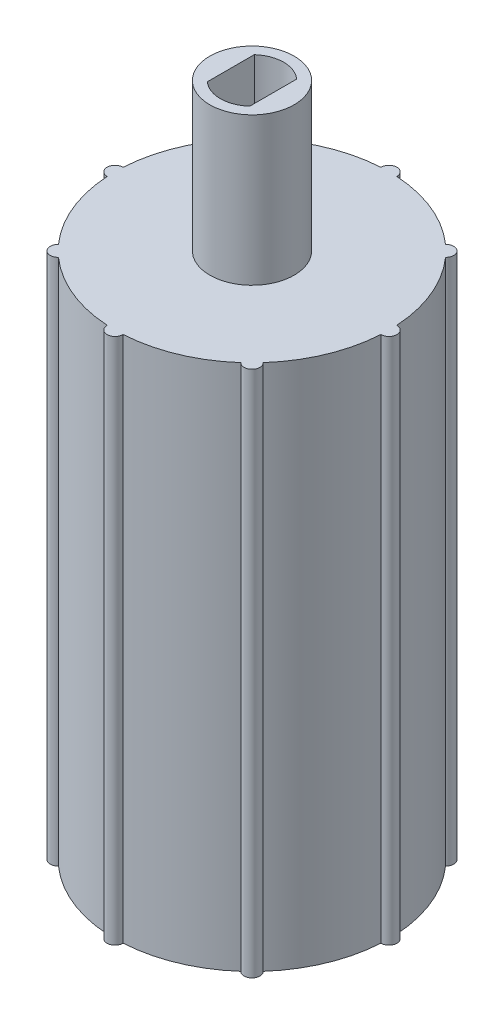
ISO-10303-21;
HEADER;
FILE_DESCRIPTION(('STEP AP214'),'2;1');
FILE_NAME('part.step','',(''),(''),'','','');
FILE_SCHEMA(('AUTOMOTIVE_DESIGN { 1 0 10303 214 1 1 1 1 }'));
ENDSEC;
DATA;
#1=APPLICATION_CONTEXT('core data for automotive mechanical design processes');
#2=APPLICATION_PROTOCOL_DEFINITION('international standard','automotive_design',2000,#1);
#3=PRODUCT_CONTEXT('',#1,'mechanical');
#4=PRODUCT('Part','Part','',(#3));
#5=PRODUCT_RELATED_PRODUCT_CATEGORY('part','',(#4));
#6=PRODUCT_DEFINITION_FORMATION('','',#4);
#7=PRODUCT_DEFINITION_CONTEXT('part definition',#1,'design');
#8=PRODUCT_DEFINITION('design','',#6,#7);
#9=PRODUCT_DEFINITION_SHAPE('','',#8);
#10=(LENGTH_UNIT() NAMED_UNIT(*) SI_UNIT(.MILLI.,.METRE.));
#11=(NAMED_UNIT(*) PLANE_ANGLE_UNIT() SI_UNIT($,.RADIAN.));
#12=(NAMED_UNIT(*) SI_UNIT($,.STERADIAN.) SOLID_ANGLE_UNIT());
#13=UNCERTAINTY_MEASURE_WITH_UNIT(LENGTH_MEASURE(1.E-05),#10,'distance_accuracy_value','');
#14=(GEOMETRIC_REPRESENTATION_CONTEXT(3) GLOBAL_UNCERTAINTY_ASSIGNED_CONTEXT((#13)) GLOBAL_UNIT_ASSIGNED_CONTEXT((#10,
#11,#12)) REPRESENTATION_CONTEXT('',''));
#15=CARTESIAN_POINT('',(0.,0.,0.));
#16=DIRECTION('',(0.,0.,1.));
#17=DIRECTION('',(1.,0.,0.));
#18=AXIS2_PLACEMENT_3D('',#15,#16,#17);
#19=CARTESIAN_POINT('',(0.,50.,0.));
#20=DIRECTION('',(0.,-1.,0.));
#21=DIRECTION('',(0.,0.,-1.));
#22=AXIS2_PLACEMENT_3D('',#19,#20,#21);
#23=CYLINDRICAL_SURFACE('',#22,9.);
#24=CARTESIAN_POINT('',(0.,7.,0.));
#25=DIRECTION('',(0.,-1.,0.));
#26=DIRECTION('',(0.,0.,-1.));
#27=AXIS2_PLACEMENT_3D('',#24,#25,#26);
#28=CIRCLE('',#27,9.);
#29=CARTESIAN_POINT('',(0.,7.,-9.));
#30=VERTEX_POINT('',#29);
#31=EDGE_CURVE('E310',#30,#30,#28,.F.);
#32=ORIENTED_EDGE('',*,*,#31,.F.);
#33=EDGE_LOOP('',(#32));
#34=FACE_BOUND('',#33,.T.);
#35=CARTESIAN_POINT('',(0.,47.,0.));
#36=DIRECTION('',(0.,1.,0.));
#37=DIRECTION('',(0.,0.,1.));
#38=AXIS2_PLACEMENT_3D('',#35,#36,#37);
#39=CIRCLE('',#38,9.);
#40=CARTESIAN_POINT('',(0.,47.,9.));
#41=VERTEX_POINT('',#40);
#42=EDGE_CURVE('E43',#41,#41,#39,.F.);
#43=ORIENTED_EDGE('',*,*,#42,.F.);
#44=EDGE_LOOP('',(#43));
#45=FACE_BOUND('',#44,.T.);
#46=ADVANCED_FACE('F39',(#34,#45),#23,.F.);
#47=CARTESIAN_POINT('',(0.,50.,0.));
#48=DIRECTION('',(0.,-1.,0.));
#49=DIRECTION('',(0.,0.,-1.));
#50=AXIS2_PLACEMENT_3D('',#47,#48,#49);
#51=CYLINDRICAL_SURFACE('',#50,13.);
#52=CARTESIAN_POINT('',(0.,0.,0.));
#53=DIRECTION('',(0.,1.,0.));
#54=DIRECTION('',(0.,0.,1.));
#55=AXIS2_PLACEMENT_3D('',#52,#53,#54);
#56=CIRCLE('',#55,13.);
#57=CARTESIAN_POINT('',(0.749687897339529,0.,12.9783653846154));
#58=VERTEX_POINT('',#57);
#59=CARTESIAN_POINT('',(8.64698077619625,0.,9.70719956816034));
#60=VERTEX_POINT('',#59);
#61=EDGE_CURVE('E323',#58,#60,#56,.T.);
#62=ORIENTED_EDGE('',*,*,#61,.T.);
#63=DIRECTION('',(0.,-1.,0.));
#64=VECTOR('',#63,1.);
#65=CARTESIAN_POINT('',(8.64698077619624,25.,9.70719956816036));
#66=LINE('',#65,#64);
#67=CARTESIAN_POINT('',(8.64698077619625,50.,9.70719956816034));
#68=VERTEX_POINT('',#67);
#69=EDGE_CURVE('E227',#60,#68,#66,.F.);
#70=ORIENTED_EDGE('',*,*,#69,.T.);
#71=CARTESIAN_POINT('',(0.,50.,0.));
#72=DIRECTION('',(0.,1.,0.));
#73=DIRECTION('',(0.,0.,1.));
#74=AXIS2_PLACEMENT_3D('',#71,#72,#73);
#75=CIRCLE('',#74,13.);
#76=CARTESIAN_POINT('',(0.749687897339512,50.,12.9783653846154));
#77=VERTEX_POINT('',#76);
#78=EDGE_CURVE('E369',#77,#68,#75,.T.);
#79=ORIENTED_EDGE('',*,*,#78,.F.);
#80=DIRECTION('',(0.,-1.,0.));
#81=VECTOR('',#80,1.);
#82=CARTESIAN_POINT('',(0.749687897339529,25.,12.9783653846154));
#83=LINE('',#82,#81);
#84=EDGE_CURVE('E233',#77,#58,#83,.T.);
#85=ORIENTED_EDGE('',*,*,#84,.T.);
#86=EDGE_LOOP('',(#62,#70,#79,#85));
#87=FACE_BOUND('',#86,.T.);
#88=ADVANCED_FACE('F385',(#87),#51,.T.);
#89=CARTESIAN_POINT('',(-8.64698077619604,0.,9.70719956816054));
#90=VERTEX_POINT('',#89);
#91=CARTESIAN_POINT('',(-0.74968789733924,0.,12.9783653846154));
#92=VERTEX_POINT('',#91);
#93=EDGE_CURVE('E325',#90,#92,#56,.T.);
#94=ORIENTED_EDGE('',*,*,#93,.T.);
#95=DIRECTION('',(0.,-1.,0.));
#96=VECTOR('',#95,1.);
#97=CARTESIAN_POINT('',(-0.749687897339257,25.,12.9783653846154));
#98=LINE('',#97,#96);
#99=CARTESIAN_POINT('',(-0.74968789733924,50.,12.9783653846154));
#100=VERTEX_POINT('',#99);
#101=EDGE_CURVE('E238',#92,#100,#98,.F.);
#102=ORIENTED_EDGE('',*,*,#101,.T.);
#103=CARTESIAN_POINT('',(-8.64698077619605,50.,9.70719956816052));
#104=VERTEX_POINT('',#103);
#105=EDGE_CURVE('E366',#104,#100,#75,.T.);
#106=ORIENTED_EDGE('',*,*,#105,.F.);
#107=DIRECTION('',(0.,-1.,0.));
#108=VECTOR('',#107,1.);
#109=CARTESIAN_POINT('',(-8.64698077619604,25.,9.70719956816054));
#110=LINE('',#109,#108);
#111=EDGE_CURVE('E244',#104,#90,#110,.T.);
#112=ORIENTED_EDGE('',*,*,#111,.T.);
#113=EDGE_LOOP('',(#94,#102,#106,#112));
#114=FACE_BOUND('',#113,.T.);
#115=ADVANCED_FACE('F392',(#114),#51,.T.);
#116=CARTESIAN_POINT('',(-12.9783653846154,0.,0.749687897339393));
#117=VERTEX_POINT('',#116);
#118=CARTESIAN_POINT('',(-9.70719956816037,0.,8.64698077619622));
#119=VERTEX_POINT('',#118);
#120=EDGE_CURVE('E328',#117,#119,#56,.T.);
#121=ORIENTED_EDGE('',*,*,#120,.T.);
#122=DIRECTION('',(0.,-1.,0.));
#123=VECTOR('',#122,1.);
#124=CARTESIAN_POINT('',(-9.70719956816039,25.,8.64698077619621));
#125=LINE('',#124,#123);
#126=CARTESIAN_POINT('',(-9.70719956816037,50.,8.64698077619622));
#127=VERTEX_POINT('',#126);
#128=EDGE_CURVE('E249',#119,#127,#125,.F.);
#129=ORIENTED_EDGE('',*,*,#128,.T.);
#130=CARTESIAN_POINT('',(-12.9783653846154,50.,0.749687897339376));
#131=VERTEX_POINT('',#130);
#132=EDGE_CURVE('E363',#131,#127,#75,.T.);
#133=ORIENTED_EDGE('',*,*,#132,.F.);
#134=DIRECTION('',(0.,-1.,0.));
#135=VECTOR('',#134,1.);
#136=CARTESIAN_POINT('',(-12.9783653846154,25.,0.749687897339393));
#137=LINE('',#136,#135);
#138=EDGE_CURVE('E255',#131,#117,#137,.T.);
#139=ORIENTED_EDGE('',*,*,#138,.T.);
#140=EDGE_LOOP('',(#121,#129,#133,#139));
#141=FACE_BOUND('',#140,.T.);
#142=ADVANCED_FACE('F395',(#141),#51,.T.);
#143=CARTESIAN_POINT('',(-9.70719956816051,0.,-8.64698077619607));
#144=VERTEX_POINT('',#143);
#145=CARTESIAN_POINT('',(-12.9783653846154,0.,-0.749687897339376));
#146=VERTEX_POINT('',#145);
#147=EDGE_CURVE('E331',#144,#146,#56,.T.);
#148=ORIENTED_EDGE('',*,*,#147,.T.);
#149=DIRECTION('',(0.,-1.,0.));
#150=VECTOR('',#149,1.);
#151=CARTESIAN_POINT('',(-12.9783653846154,25.,-0.749687897339393));
#152=LINE('',#151,#150);
#153=CARTESIAN_POINT('',(-12.9783653846154,50.,-0.749687897339376));
#154=VERTEX_POINT('',#153);
#155=EDGE_CURVE('E260',#146,#154,#152,.F.);
#156=ORIENTED_EDGE('',*,*,#155,.T.);
#157=CARTESIAN_POINT('',(-9.70719956816049,50.,-8.64698077619608));
#158=VERTEX_POINT('',#157);
#159=EDGE_CURVE('E361',#158,#154,#75,.T.);
#160=ORIENTED_EDGE('',*,*,#159,.F.);
#161=DIRECTION('',(0.,-1.,0.));
#162=VECTOR('',#161,1.);
#163=CARTESIAN_POINT('',(-9.70719956816051,25.,-8.64698077619607));
#164=LINE('',#163,#162);
#165=EDGE_CURVE('E266',#158,#144,#164,.T.);
#166=ORIENTED_EDGE('',*,*,#165,.T.);
#167=EDGE_LOOP('',(#148,#156,#160,#166));
#168=FACE_BOUND('',#167,.T.);
#169=ADVANCED_FACE('F401',(#168),#51,.T.);
#170=CARTESIAN_POINT('',(-0.749687897339438,0.,-12.9783653846154));
#171=VERTEX_POINT('',#170);
#172=CARTESIAN_POINT('',(-8.64698077619619,0.,-9.7071995681604));
#173=VERTEX_POINT('',#172);
#174=EDGE_CURVE('E334',#171,#173,#56,.T.);
#175=ORIENTED_EDGE('',*,*,#174,.T.);
#176=DIRECTION('',(0.,-1.,0.));
#177=VECTOR('',#176,1.);
#178=CARTESIAN_POINT('',(-8.64698077619617,25.,-9.70719956816041));
#179=LINE('',#178,#177);
#180=CARTESIAN_POINT('',(-8.64698077619619,50.,-9.7071995681604));
#181=VERTEX_POINT('',#180);
#182=EDGE_CURVE('E271',#173,#181,#179,.F.);
#183=ORIENTED_EDGE('',*,*,#182,.T.);
#184=CARTESIAN_POINT('',(-0.749687897339422,50.,-12.9783653846154));
#185=VERTEX_POINT('',#184);
#186=EDGE_CURVE('E355',#185,#181,#75,.T.);
#187=ORIENTED_EDGE('',*,*,#186,.F.);
#188=DIRECTION('',(0.,-1.,0.));
#189=VECTOR('',#188,1.);
#190=CARTESIAN_POINT('',(-0.749687897339438,25.,-12.9783653846154));
#191=LINE('',#190,#189);
#192=EDGE_CURVE('E277',#185,#171,#191,.T.);
#193=ORIENTED_EDGE('',*,*,#192,.T.);
#194=EDGE_LOOP('',(#175,#183,#187,#193));
#195=FACE_BOUND('',#194,.T.);
#196=ADVANCED_FACE('F353',(#195),#51,.T.);
#197=CARTESIAN_POINT('',(8.64698077619611,0.,-9.70719956816048));
#198=VERTEX_POINT('',#197);
#199=CARTESIAN_POINT('',(0.749687897339331,0.,-12.9783653846154));
#200=VERTEX_POINT('',#199);
#201=EDGE_CURVE('E318',#198,#200,#56,.T.);
#202=ORIENTED_EDGE('',*,*,#201,.T.);
#203=DIRECTION('',(0.,-1.,0.));
#204=VECTOR('',#203,1.);
#205=CARTESIAN_POINT('',(0.749687897339348,25.,-12.9783653846154));
#206=LINE('',#205,#204);
#207=CARTESIAN_POINT('',(0.749687897339331,50.,-12.9783653846154));
#208=VERTEX_POINT('',#207);
#209=EDGE_CURVE('E282',#200,#208,#206,.F.);
#210=ORIENTED_EDGE('',*,*,#209,.T.);
#211=CARTESIAN_POINT('',(8.64698077619612,50.,-9.70719956816046));
#212=VERTEX_POINT('',#211);
#213=EDGE_CURVE('E316',#212,#208,#75,.T.);
#214=ORIENTED_EDGE('',*,*,#213,.F.);
#215=DIRECTION('',(0.,-1.,0.));
#216=VECTOR('',#215,1.);
#217=CARTESIAN_POINT('',(8.64698077619611,25.,-9.70719956816048));
#218=LINE('',#217,#216);
#219=EDGE_CURVE('E288',#212,#198,#218,.T.);
#220=ORIENTED_EDGE('',*,*,#219,.T.);
#221=EDGE_LOOP('',(#202,#210,#214,#220));
#222=FACE_BOUND('',#221,.T.);
#223=ADVANCED_FACE('F341',(#222),#51,.T.);
#224=CARTESIAN_POINT('',(12.9783653846154,0.,-0.749687897339393));
#225=VERTEX_POINT('',#224);
#226=CARTESIAN_POINT('',(9.70719956816043,0.,-8.64698077619615));
#227=VERTEX_POINT('',#226);
#228=EDGE_CURVE('E317',#225,#227,#56,.T.);
#229=ORIENTED_EDGE('',*,*,#228,.T.);
#230=DIRECTION('',(0.,-1.,0.));
#231=VECTOR('',#230,1.);
#232=CARTESIAN_POINT('',(9.70719956816045,25.,-8.64698077619614));
#233=LINE('',#232,#231);
#234=CARTESIAN_POINT('',(9.70719956816043,50.,-8.64698077619615));
#235=VERTEX_POINT('',#234);
#236=EDGE_CURVE('E293',#227,#235,#233,.F.);
#237=ORIENTED_EDGE('',*,*,#236,.T.);
#238=CARTESIAN_POINT('',(12.9783653846154,50.,-0.749687897339376));
#239=VERTEX_POINT('',#238);
#240=EDGE_CURVE('E313',#239,#235,#75,.T.);
#241=ORIENTED_EDGE('',*,*,#240,.F.);
#242=DIRECTION('',(0.,-1.,0.));
#243=VECTOR('',#242,1.);
#244=CARTESIAN_POINT('',(12.9783653846154,25.,-0.749687897339393));
#245=LINE('',#244,#243);
#246=EDGE_CURVE('E299',#239,#225,#245,.T.);
#247=ORIENTED_EDGE('',*,*,#246,.T.);
#248=EDGE_LOOP('',(#229,#237,#241,#247));
#249=FACE_BOUND('',#248,.T.);
#250=ADVANCED_FACE('F378',(#249),#51,.T.);
#251=CARTESIAN_POINT('',(9.70719956816056,50.,8.64698077619602));
#252=VERTEX_POINT('',#251);
#253=CARTESIAN_POINT('',(12.9783653846154,50.,0.749687897339376));
#254=VERTEX_POINT('',#253);
#255=EDGE_CURVE('E63',#252,#254,#75,.T.);
#256=ORIENTED_EDGE('',*,*,#255,.F.);
#257=DIRECTION('',(0.,-1.,0.));
#258=VECTOR('',#257,1.);
#259=CARTESIAN_POINT('',(9.70719956816057,25.,8.646980776196));
#260=LINE('',#259,#258);
#261=CARTESIAN_POINT('',(9.70719956816057,0.,8.646980776196));
#262=VERTEX_POINT('',#261);
#263=EDGE_CURVE('E223',#252,#262,#260,.T.);
#264=ORIENTED_EDGE('',*,*,#263,.T.);
#265=CARTESIAN_POINT('',(12.9783653846154,0.,0.749687897339376));
#266=VERTEX_POINT('',#265);
#267=EDGE_CURVE('E319',#262,#266,#56,.T.);
#268=ORIENTED_EDGE('',*,*,#267,.T.);
#269=DIRECTION('',(0.,-1.,0.));
#270=VECTOR('',#269,1.);
#271=CARTESIAN_POINT('',(12.9783653846154,25.,0.749687897339393));
#272=LINE('',#271,#270);
#273=EDGE_CURVE('E304',#266,#254,#272,.F.);
#274=ORIENTED_EDGE('',*,*,#273,.T.);
#275=EDGE_LOOP('',(#256,#264,#268,#274));
#276=FACE_BOUND('',#275,.T.);
#277=ADVANCED_FACE('F41',(#276),#51,.T.);
#278=CARTESIAN_POINT('',(0.,50.,0.));
#279=DIRECTION('',(0.,1.,0.));
#280=DIRECTION('',(0.,0.,1.));
#281=AXIS2_PLACEMENT_3D('',#278,#279,#280);
#282=PLANE('',#281);
#283=CARTESIAN_POINT('',(0.,50.,0.));
#284=DIRECTION('',(0.,1.,0.));
#285=DIRECTION('',(0.,0.,1.));
#286=AXIS2_PLACEMENT_3D('',#283,#284,#285);
#287=CIRCLE('',#286,4.);
#288=CARTESIAN_POINT('',(0.,50.,4.));
#289=VERTEX_POINT('',#288);
#290=EDGE_CURVE('E11',#289,#289,#287,.T.);
#291=ORIENTED_EDGE('',*,*,#290,.F.);
#292=EDGE_LOOP('',(#291));
#293=FACE_BOUND('',#292,.T.);
#294=ORIENTED_EDGE('',*,*,#78,.T.);
#295=CARTESIAN_POINT('',(9.19238815542523,50.,9.192388155425));
#296=DIRECTION('',(0.,-1.,0.));
#297=DIRECTION('',(0.707106781186539,0.,-0.707106781186556));
#298=AXIS2_PLACEMENT_3D('',#295,#296,#297);
#299=CIRCLE('',#298,0.75);
#300=EDGE_CURVE('E220',#252,#68,#299,.T.);
#301=ORIENTED_EDGE('',*,*,#300,.F.);
#302=ORIENTED_EDGE('',*,*,#255,.T.);
#303=CARTESIAN_POINT('',(13.,50.,0.));
#304=DIRECTION('',(0.,-1.,0.));
#305=DIRECTION('',(0.,0.,-1.));
#306=AXIS2_PLACEMENT_3D('',#303,#304,#305);
#307=CIRCLE('',#306,0.75);
#308=EDGE_CURVE('E296',#239,#254,#307,.T.);
#309=ORIENTED_EDGE('',*,*,#308,.F.);
#310=ORIENTED_EDGE('',*,*,#240,.T.);
#311=CARTESIAN_POINT('',(9.1923881554251,50.,-9.19238815542513));
#312=DIRECTION('',(0.,-1.,0.));
#313=DIRECTION('',(-0.707106781186549,0.,-0.707106781186546));
#314=AXIS2_PLACEMENT_3D('',#311,#312,#313);
#315=CIRCLE('',#314,0.75);
#316=EDGE_CURVE('E285',#212,#235,#315,.T.);
#317=ORIENTED_EDGE('',*,*,#316,.F.);
#318=ORIENTED_EDGE('',*,*,#213,.T.);
#319=CARTESIAN_POINT('',(0.,50.,-13.));
#320=DIRECTION('',(0.,-1.,0.));
#321=DIRECTION('',(-1.,0.,0.));
#322=AXIS2_PLACEMENT_3D('',#319,#320,#321);
#323=CIRCLE('',#322,0.75);
#324=EDGE_CURVE('E274',#185,#208,#323,.T.);
#325=ORIENTED_EDGE('',*,*,#324,.F.);
#326=ORIENTED_EDGE('',*,*,#186,.T.);
#327=CARTESIAN_POINT('',(-9.19238815542517,50.,-9.19238815542507));
#328=DIRECTION('',(0.,-1.,0.));
#329=DIRECTION('',(-0.707106781186544,0.,0.707106781186551));
#330=AXIS2_PLACEMENT_3D('',#327,#328,#329);
#331=CIRCLE('',#330,0.75);
#332=EDGE_CURVE('E263',#158,#181,#331,.T.);
#333=ORIENTED_EDGE('',*,*,#332,.F.);
#334=ORIENTED_EDGE('',*,*,#159,.T.);
#335=CARTESIAN_POINT('',(-13.,50.,0.));
#336=DIRECTION('',(0.,-1.,0.));
#337=DIRECTION('',(0.,0.,1.));
#338=AXIS2_PLACEMENT_3D('',#335,#336,#337);
#339=CIRCLE('',#338,0.75);
#340=EDGE_CURVE('E252',#131,#154,#339,.T.);
#341=ORIENTED_EDGE('',*,*,#340,.F.);
#342=ORIENTED_EDGE('',*,*,#132,.T.);
#343=CARTESIAN_POINT('',(-9.19238815542504,50.,9.1923881554252));
#344=DIRECTION('',(0.,-1.,0.));
#345=DIRECTION('',(0.707106781186554,0.,0.707106781186541));
#346=AXIS2_PLACEMENT_3D('',#343,#344,#345);
#347=CIRCLE('',#346,0.75);
#348=EDGE_CURVE('E241',#104,#127,#347,.T.);
#349=ORIENTED_EDGE('',*,*,#348,.F.);
#350=ORIENTED_EDGE('',*,*,#105,.T.);
#351=CARTESIAN_POINT('',(1.36167772214882E-13,50.,13.));
#352=DIRECTION('',(0.,-1.,0.));
#353=DIRECTION('',(1.,0.,0.));
#354=AXIS2_PLACEMENT_3D('',#351,#352,#353);
#355=CIRCLE('',#354,0.75);
#356=EDGE_CURVE('E230',#77,#100,#355,.T.);
#357=ORIENTED_EDGE('',*,*,#356,.F.);
#358=EDGE_LOOP('',(#294,#301,#302,#309,#310,#317,#318,#325,#326,#333,#334,#341,#342,#349,#350,#357));
#359=FACE_BOUND('',#358,.T.);
#360=ADVANCED_FACE('F358',(#293,#359),#282,.T.);
#361=CARTESIAN_POINT('',(0.,0.,0.));
#362=DIRECTION('',(0.,1.,0.));
#363=DIRECTION('',(0.,0.,1.));
#364=AXIS2_PLACEMENT_3D('',#361,#362,#363);
#365=PLANE('',#364);
#366=CARTESIAN_POINT('',(0.,0.,0.));
#367=DIRECTION('',(0.,-1.,0.));
#368=DIRECTION('',(0.,0.,-1.));
#369=AXIS2_PLACEMENT_3D('',#366,#367,#368);
#370=CIRCLE('',#369,11.);
#371=CARTESIAN_POINT('',(0.,0.,-11.));
#372=VERTEX_POINT('',#371);
#373=EDGE_CURVE('E306',#372,#372,#370,.T.);
#374=ORIENTED_EDGE('',*,*,#373,.F.);
#375=EDGE_LOOP('',(#374));
#376=FACE_BOUND('',#375,.T.);
#377=ORIENTED_EDGE('',*,*,#267,.F.);
#378=CARTESIAN_POINT('',(9.19238815542523,0.,9.192388155425));
#379=DIRECTION('',(0.,-1.,0.));
#380=DIRECTION('',(0.707106781186539,0.,-0.707106781186556));
#381=AXIS2_PLACEMENT_3D('',#378,#379,#380);
#382=CIRCLE('',#381,0.75);
#383=EDGE_CURVE('E218',#262,#60,#382,.T.);
#384=ORIENTED_EDGE('',*,*,#383,.T.);
#385=ORIENTED_EDGE('',*,*,#61,.F.);
#386=CARTESIAN_POINT('',(1.36167772214882E-13,0.,13.));
#387=DIRECTION('',(0.,-1.,0.));
#388=DIRECTION('',(1.,0.,0.));
#389=AXIS2_PLACEMENT_3D('',#386,#387,#388);
#390=CIRCLE('',#389,0.75);
#391=EDGE_CURVE('E229',#58,#92,#390,.T.);
#392=ORIENTED_EDGE('',*,*,#391,.T.);
#393=ORIENTED_EDGE('',*,*,#93,.F.);
#394=CARTESIAN_POINT('',(-9.19238815542504,0.,9.1923881554252));
#395=DIRECTION('',(0.,-1.,0.));
#396=DIRECTION('',(0.707106781186554,0.,0.707106781186541));
#397=AXIS2_PLACEMENT_3D('',#394,#395,#396);
#398=CIRCLE('',#397,0.75);
#399=EDGE_CURVE('E240',#90,#119,#398,.T.);
#400=ORIENTED_EDGE('',*,*,#399,.T.);
#401=ORIENTED_EDGE('',*,*,#120,.F.);
#402=CARTESIAN_POINT('',(-13.,0.,0.));
#403=DIRECTION('',(0.,-1.,0.));
#404=DIRECTION('',(0.,0.,1.));
#405=AXIS2_PLACEMENT_3D('',#402,#403,#404);
#406=CIRCLE('',#405,0.75);
#407=EDGE_CURVE('E251',#117,#146,#406,.T.);
#408=ORIENTED_EDGE('',*,*,#407,.T.);
#409=ORIENTED_EDGE('',*,*,#147,.F.);
#410=CARTESIAN_POINT('',(-9.19238815542517,0.,-9.19238815542507));
#411=DIRECTION('',(0.,-1.,0.));
#412=DIRECTION('',(-0.707106781186544,0.,0.707106781186551));
#413=AXIS2_PLACEMENT_3D('',#410,#411,#412);
#414=CIRCLE('',#413,0.75);
#415=EDGE_CURVE('E262',#144,#173,#414,.T.);
#416=ORIENTED_EDGE('',*,*,#415,.T.);
#417=ORIENTED_EDGE('',*,*,#174,.F.);
#418=CARTESIAN_POINT('',(0.,0.,-13.));
#419=DIRECTION('',(0.,-1.,0.));
#420=DIRECTION('',(-1.,0.,0.));
#421=AXIS2_PLACEMENT_3D('',#418,#419,#420);
#422=CIRCLE('',#421,0.75);
#423=EDGE_CURVE('E273',#171,#200,#422,.T.);
#424=ORIENTED_EDGE('',*,*,#423,.T.);
#425=ORIENTED_EDGE('',*,*,#201,.F.);
#426=CARTESIAN_POINT('',(9.1923881554251,0.,-9.19238815542513));
#427=DIRECTION('',(0.,-1.,0.));
#428=DIRECTION('',(-0.707106781186549,0.,-0.707106781186546));
#429=AXIS2_PLACEMENT_3D('',#426,#427,#428);
#430=CIRCLE('',#429,0.75);
#431=EDGE_CURVE('E284',#198,#227,#430,.T.);
#432=ORIENTED_EDGE('',*,*,#431,.T.);
#433=ORIENTED_EDGE('',*,*,#228,.F.);
#434=CARTESIAN_POINT('',(13.,0.,0.));
#435=DIRECTION('',(0.,-1.,0.));
#436=DIRECTION('',(0.,0.,-1.));
#437=AXIS2_PLACEMENT_3D('',#434,#435,#436);
#438=CIRCLE('',#437,0.75);
#439=EDGE_CURVE('E295',#225,#266,#438,.T.);
#440=ORIENTED_EDGE('',*,*,#439,.T.);
#441=EDGE_LOOP('',(#377,#384,#385,#392,#393,#400,#401,#408,#409,#416,#417,#424,#425,#432,#433,#440));
#442=FACE_BOUND('',#441,.T.);
#443=ADVANCED_FACE('F351',(#376,#442),#365,.F.);
#444=CARTESIAN_POINT('',(0.,7.,0.));
#445=DIRECTION('',(0.,-1.,0.));
#446=DIRECTION('',(0.,0.,-1.));
#447=AXIS2_PLACEMENT_3D('',#444,#445,#446);
#448=PLANE('',#447);
#449=CARTESIAN_POINT('',(0.,7.,0.));
#450=DIRECTION('',(0.,-1.,0.));
#451=DIRECTION('',(0.,0.,-1.));
#452=AXIS2_PLACEMENT_3D('',#449,#450,#451);
#453=CIRCLE('',#452,11.);
#454=CARTESIAN_POINT('',(0.,7.,-11.));
#455=VERTEX_POINT('',#454);
#456=EDGE_CURVE('E307',#455,#455,#453,.T.);
#457=ORIENTED_EDGE('',*,*,#456,.T.);
#458=EDGE_LOOP('',(#457));
#459=FACE_BOUND('',#458,.T.);
#460=ORIENTED_EDGE('',*,*,#31,.T.);
#461=EDGE_LOOP('',(#460));
#462=FACE_BOUND('',#461,.T.);
#463=ADVANCED_FACE('F428',(#459,#462),#448,.T.);
#464=CARTESIAN_POINT('',(0.,7.,0.));
#465=DIRECTION('',(0.,-1.,0.));
#466=DIRECTION('',(0.,0.,-1.));
#467=AXIS2_PLACEMENT_3D('',#464,#465,#466);
#468=CYLINDRICAL_SURFACE('',#467,11.);
#469=ORIENTED_EDGE('',*,*,#456,.F.);
#470=EDGE_LOOP('',(#469));
#471=FACE_BOUND('',#470,.T.);
#472=ORIENTED_EDGE('',*,*,#373,.T.);
#473=EDGE_LOOP('',(#472));
#474=FACE_BOUND('',#473,.T.);
#475=ADVANCED_FACE('F423',(#471,#474),#468,.F.);
#476=CARTESIAN_POINT('',(13.,50.,0.));
#477=DIRECTION('',(0.,-1.,0.));
#478=DIRECTION('',(0.,0.,-1.));
#479=AXIS2_PLACEMENT_3D('',#476,#477,#478);
#480=CYLINDRICAL_SURFACE('',#479,0.75);
#481=ORIENTED_EDGE('',*,*,#273,.F.);
#482=ORIENTED_EDGE('',*,*,#439,.F.);
#483=ORIENTED_EDGE('',*,*,#246,.F.);
#484=ORIENTED_EDGE('',*,*,#308,.T.);
#485=EDGE_LOOP('',(#481,#482,#483,#484));
#486=FACE_BOUND('',#485,.T.);
#487=ADVANCED_FACE('F376',(#486),#480,.T.);
#488=CARTESIAN_POINT('',(9.1923881554251,50.,-9.19238815542513));
#489=DIRECTION('',(0.,-1.,0.));
#490=DIRECTION('',(0.,0.,-1.));
#491=AXIS2_PLACEMENT_3D('',#488,#489,#490);
#492=CYLINDRICAL_SURFACE('',#491,0.75);
#493=ORIENTED_EDGE('',*,*,#236,.F.);
#494=ORIENTED_EDGE('',*,*,#431,.F.);
#495=ORIENTED_EDGE('',*,*,#219,.F.);
#496=ORIENTED_EDGE('',*,*,#316,.T.);
#497=EDGE_LOOP('',(#493,#494,#495,#496));
#498=FACE_BOUND('',#497,.T.);
#499=ADVANCED_FACE('F381',(#498),#492,.T.);
#500=CARTESIAN_POINT('',(0.,50.,-13.));
#501=DIRECTION('',(0.,-1.,0.));
#502=DIRECTION('',(0.,0.,-1.));
#503=AXIS2_PLACEMENT_3D('',#500,#501,#502);
#504=CYLINDRICAL_SURFACE('',#503,0.75);
#505=ORIENTED_EDGE('',*,*,#209,.F.);
#506=ORIENTED_EDGE('',*,*,#423,.F.);
#507=ORIENTED_EDGE('',*,*,#192,.F.);
#508=ORIENTED_EDGE('',*,*,#324,.T.);
#509=EDGE_LOOP('',(#505,#506,#507,#508));
#510=FACE_BOUND('',#509,.T.);
#511=ADVANCED_FACE('F348',(#510),#504,.T.);
#512=CARTESIAN_POINT('',(-9.19238815542517,50.,-9.19238815542507));
#513=DIRECTION('',(0.,-1.,0.));
#514=DIRECTION('',(0.,0.,-1.));
#515=AXIS2_PLACEMENT_3D('',#512,#513,#514);
#516=CYLINDRICAL_SURFACE('',#515,0.75);
#517=ORIENTED_EDGE('',*,*,#182,.F.);
#518=ORIENTED_EDGE('',*,*,#415,.F.);
#519=ORIENTED_EDGE('',*,*,#165,.F.);
#520=ORIENTED_EDGE('',*,*,#332,.T.);
#521=EDGE_LOOP('',(#517,#518,#519,#520));
#522=FACE_BOUND('',#521,.T.);
#523=ADVANCED_FACE('F403',(#522),#516,.T.);
#524=CARTESIAN_POINT('',(-13.,50.,0.));
#525=DIRECTION('',(0.,-1.,0.));
#526=DIRECTION('',(0.,0.,-1.));
#527=AXIS2_PLACEMENT_3D('',#524,#525,#526);
#528=CYLINDRICAL_SURFACE('',#527,0.75);
#529=ORIENTED_EDGE('',*,*,#155,.F.);
#530=ORIENTED_EDGE('',*,*,#407,.F.);
#531=ORIENTED_EDGE('',*,*,#138,.F.);
#532=ORIENTED_EDGE('',*,*,#340,.T.);
#533=EDGE_LOOP('',(#529,#530,#531,#532));
#534=FACE_BOUND('',#533,.T.);
#535=ADVANCED_FACE('F399',(#534),#528,.T.);
#536=CARTESIAN_POINT('',(-9.19238815542504,50.,9.1923881554252));
#537=DIRECTION('',(0.,-1.,0.));
#538=DIRECTION('',(0.,0.,-1.));
#539=AXIS2_PLACEMENT_3D('',#536,#537,#538);
#540=CYLINDRICAL_SURFACE('',#539,0.75);
#541=ORIENTED_EDGE('',*,*,#128,.F.);
#542=ORIENTED_EDGE('',*,*,#399,.F.);
#543=ORIENTED_EDGE('',*,*,#111,.F.);
#544=ORIENTED_EDGE('',*,*,#348,.T.);
#545=EDGE_LOOP('',(#541,#542,#543,#544));
#546=FACE_BOUND('',#545,.T.);
#547=ADVANCED_FACE('F394',(#546),#540,.T.);
#548=CARTESIAN_POINT('',(1.36167772214882E-13,50.,13.));
#549=DIRECTION('',(0.,-1.,0.));
#550=DIRECTION('',(0.,0.,-1.));
#551=AXIS2_PLACEMENT_3D('',#548,#549,#550);
#552=CYLINDRICAL_SURFACE('',#551,0.75);
#553=ORIENTED_EDGE('',*,*,#101,.F.);
#554=ORIENTED_EDGE('',*,*,#391,.F.);
#555=ORIENTED_EDGE('',*,*,#84,.F.);
#556=ORIENTED_EDGE('',*,*,#356,.T.);
#557=EDGE_LOOP('',(#553,#554,#555,#556));
#558=FACE_BOUND('',#557,.T.);
#559=ADVANCED_FACE('F389',(#558),#552,.T.);
#560=CARTESIAN_POINT('',(9.19238815542523,50.,9.192388155425));
#561=DIRECTION('',(0.,-1.,0.));
#562=DIRECTION('',(0.,0.,-1.));
#563=AXIS2_PLACEMENT_3D('',#560,#561,#562);
#564=CYLINDRICAL_SURFACE('',#563,0.75);
#565=ORIENTED_EDGE('',*,*,#69,.F.);
#566=ORIENTED_EDGE('',*,*,#383,.F.);
#567=ORIENTED_EDGE('',*,*,#263,.F.);
#568=ORIENTED_EDGE('',*,*,#300,.T.);
#569=EDGE_LOOP('',(#565,#566,#567,#568));
#570=FACE_BOUND('',#569,.T.);
#571=ADVANCED_FACE('F384',(#570),#564,.T.);
#572=CARTESIAN_POINT('',(0.,47.,0.));
#573=DIRECTION('',(0.,1.,0.));
#574=DIRECTION('',(0.,0.,1.));
#575=AXIS2_PLACEMENT_3D('',#572,#573,#574);
#576=PLANE('',#575);
#577=ORIENTED_EDGE('',*,*,#42,.T.);
#578=EDGE_LOOP('',(#577));
#579=FACE_BOUND('',#578,.T.);
#580=ADVANCED_FACE('F489',(#579),#576,.F.);
#581=CARTESIAN_POINT('',(0.,64.,0.));
#582=DIRECTION('',(0.,-1.,0.));
#583=DIRECTION('',(0.,0.,-1.));
#584=AXIS2_PLACEMENT_3D('',#581,#582,#583);
#585=CYLINDRICAL_SURFACE('',#584,4.);
#586=CARTESIAN_POINT('',(0.,64.,0.));
#587=DIRECTION('',(0.,1.,0.));
#588=DIRECTION('',(0.,0.,1.));
#589=AXIS2_PLACEMENT_3D('',#586,#587,#588);
#590=CIRCLE('',#589,4.);
#591=CARTESIAN_POINT('',(0.,64.,4.));
#592=VERTEX_POINT('',#591);
#593=EDGE_CURVE('E213',#592,#592,#590,.T.);
#594=ORIENTED_EDGE('',*,*,#593,.F.);
#595=EDGE_LOOP('',(#594));
#596=FACE_BOUND('',#595,.T.);
#597=ORIENTED_EDGE('',*,*,#290,.T.);
#598=EDGE_LOOP('',(#597));
#599=FACE_BOUND('',#598,.T.);
#600=ADVANCED_FACE('F512',(#596,#599),#585,.T.);
#601=CARTESIAN_POINT('',(0.,64.,0.));
#602=DIRECTION('',(0.,1.,0.));
#603=DIRECTION('',(0.,0.,1.));
#604=AXIS2_PLACEMENT_3D('',#601,#602,#603);
#605=PLANE('',#604);
#606=CARTESIAN_POINT('',(0.,64.,0.));
#607=DIRECTION('',(0.,1.,0.));
#608=DIRECTION('',(0.,0.,1.));
#609=AXIS2_PLACEMENT_3D('',#606,#607,#608);
#610=CIRCLE('',#609,3.);
#611=CARTESIAN_POINT('',(2.00985368719878,64.,-2.22721533670488));
#612=VERTEX_POINT('',#611);
#613=CARTESIAN_POINT('',(-2.00985368719878,64.,-2.22721533670488));
#614=VERTEX_POINT('',#613);
#615=EDGE_CURVE('E55',#612,#614,#610,.T.);
#616=ORIENTED_EDGE('',*,*,#615,.F.);
#617=DIRECTION('',(0.,0.,-1.));
#618=VECTOR('',#617,1.);
#619=CARTESIAN_POINT('',(2.00985368719878,64.,2.22721533670488));
#620=LINE('',#619,#618);
#621=CARTESIAN_POINT('',(2.00985368719879,64.,2.22721533670488));
#622=VERTEX_POINT('',#621);
#623=EDGE_CURVE('E198',#622,#612,#620,.T.);
#624=ORIENTED_EDGE('',*,*,#623,.F.);
#625=CARTESIAN_POINT('',(0.,64.,0.));
#626=DIRECTION('',(0.,1.,0.));
#627=DIRECTION('',(0.,0.,1.));
#628=AXIS2_PLACEMENT_3D('',#625,#626,#627);
#629=CIRCLE('',#628,3.);
#630=CARTESIAN_POINT('',(-2.00985368719879,64.,2.22721533670488));
#631=VERTEX_POINT('',#630);
#632=EDGE_CURVE('E201',#631,#622,#629,.T.);
#633=ORIENTED_EDGE('',*,*,#632,.F.);
#634=DIRECTION('',(0.,0.,1.));
#635=VECTOR('',#634,1.);
#636=CARTESIAN_POINT('',(-2.00985368719879,64.,2.22721533670488));
#637=LINE('',#636,#635);
#638=EDGE_CURVE('E207',#614,#631,#637,.T.);
#639=ORIENTED_EDGE('',*,*,#638,.F.);
#640=EDGE_LOOP('',(#616,#624,#633,#639));
#641=FACE_BOUND('',#640,.T.);
#642=ORIENTED_EDGE('',*,*,#593,.T.);
#643=EDGE_LOOP('',(#642));
#644=FACE_BOUND('',#643,.T.);
#645=ADVANCED_FACE('F521',(#641,#644),#605,.T.);
#646=CARTESIAN_POINT('',(0.,50.,0.));
#647=DIRECTION('',(0.,1.,0.));
#648=DIRECTION('',(0.,0.,1.));
#649=AXIS2_PLACEMENT_3D('',#646,#647,#648);
#650=CYLINDRICAL_SURFACE('',#649,3.);
#651=ORIENTED_EDGE('',*,*,#615,.T.);
#652=DIRECTION('',(0.,1.,0.));
#653=VECTOR('',#652,1.);
#654=CARTESIAN_POINT('',(-2.00985368719878,50.,-2.22721533670488));
#655=LINE('',#654,#653);
#656=CARTESIAN_POINT('',(-2.00985368719878,50.,-2.22721533670488));
#657=VERTEX_POINT('',#656);
#658=EDGE_CURVE('E176',#657,#614,#655,.T.);
#659=ORIENTED_EDGE('',*,*,#658,.F.);
#660=CARTESIAN_POINT('',(0.,50.,0.));
#661=DIRECTION('',(0.,1.,0.));
#662=DIRECTION('',(0.,0.,1.));
#663=AXIS2_PLACEMENT_3D('',#660,#661,#662);
#664=CIRCLE('',#663,3.);
#665=CARTESIAN_POINT('',(2.00985368719878,50.,-2.22721533670488));
#666=VERTEX_POINT('',#665);
#667=EDGE_CURVE('E180',#666,#657,#664,.T.);
#668=ORIENTED_EDGE('',*,*,#667,.F.);
#669=DIRECTION('',(0.,1.,0.));
#670=VECTOR('',#669,1.);
#671=CARTESIAN_POINT('',(2.00985368719878,50.,-2.22721533670488));
#672=LINE('',#671,#670);
#673=EDGE_CURVE('E211',#666,#612,#672,.T.);
#674=ORIENTED_EDGE('',*,*,#673,.T.);
#675=EDGE_LOOP('',(#651,#659,#668,#674));
#676=FACE_BOUND('',#675,.T.);
#677=ADVANCED_FACE('F178',(#676),#650,.F.);
#678=CARTESIAN_POINT('',(2.00985368719878,50.,2.22721533670488));
#679=DIRECTION('',(1.,0.,0.));
#680=DIRECTION('',(0.,0.,-1.));
#681=AXIS2_PLACEMENT_3D('',#678,#679,#680);
#682=PLANE('',#681);
#683=ORIENTED_EDGE('',*,*,#623,.T.);
#684=ORIENTED_EDGE('',*,*,#673,.F.);
#685=DIRECTION('',(0.,0.,-1.));
#686=VECTOR('',#685,1.);
#687=CARTESIAN_POINT('',(2.00985368719878,50.,2.22721533670488));
#688=LINE('',#687,#686);
#689=CARTESIAN_POINT('',(2.00985368719879,50.,2.22721533670488));
#690=VERTEX_POINT('',#689);
#691=EDGE_CURVE('E186',#690,#666,#688,.T.);
#692=ORIENTED_EDGE('',*,*,#691,.F.);
#693=DIRECTION('',(0.,1.,0.));
#694=VECTOR('',#693,1.);
#695=CARTESIAN_POINT('',(2.00985368719879,50.,2.22721533670488));
#696=LINE('',#695,#694);
#697=EDGE_CURVE('E214',#690,#622,#696,.T.);
#698=ORIENTED_EDGE('',*,*,#697,.T.);
#699=EDGE_LOOP('',(#683,#684,#692,#698));
#700=FACE_BOUND('',#699,.T.);
#701=ADVANCED_FACE('F540',(#700),#682,.F.);
#702=CARTESIAN_POINT('',(0.,50.,0.));
#703=DIRECTION('',(0.,1.,0.));
#704=DIRECTION('',(0.,0.,1.));
#705=AXIS2_PLACEMENT_3D('',#702,#703,#704);
#706=CYLINDRICAL_SURFACE('',#705,3.);
#707=ORIENTED_EDGE('',*,*,#632,.T.);
#708=ORIENTED_EDGE('',*,*,#697,.F.);
#709=CARTESIAN_POINT('',(0.,50.,0.));
#710=DIRECTION('',(0.,1.,0.));
#711=DIRECTION('',(0.,0.,1.));
#712=AXIS2_PLACEMENT_3D('',#709,#710,#711);
#713=CIRCLE('',#712,3.);
#714=CARTESIAN_POINT('',(-2.00985368719879,50.,2.22721533670488));
#715=VERTEX_POINT('',#714);
#716=EDGE_CURVE('E194',#715,#690,#713,.T.);
#717=ORIENTED_EDGE('',*,*,#716,.F.);
#718=DIRECTION('',(0.,1.,0.));
#719=VECTOR('',#718,1.);
#720=CARTESIAN_POINT('',(-2.00985368719879,50.,2.22721533670488));
#721=LINE('',#720,#719);
#722=EDGE_CURVE('E185',#715,#631,#721,.T.);
#723=ORIENTED_EDGE('',*,*,#722,.T.);
#724=EDGE_LOOP('',(#707,#708,#717,#723));
#725=FACE_BOUND('',#724,.T.);
#726=ADVANCED_FACE('F549',(#725),#706,.F.);
#727=CARTESIAN_POINT('',(-2.00985368719879,50.,2.22721533670488));
#728=DIRECTION('',(-1.,0.,0.));
#729=DIRECTION('',(0.,0.,1.));
#730=AXIS2_PLACEMENT_3D('',#727,#728,#729);
#731=PLANE('',#730);
#732=ORIENTED_EDGE('',*,*,#638,.T.);
#733=ORIENTED_EDGE('',*,*,#722,.F.);
#734=DIRECTION('',(0.,0.,1.));
#735=VECTOR('',#734,1.);
#736=CARTESIAN_POINT('',(-2.00985368719879,50.,2.22721533670488));
#737=LINE('',#736,#735);
#738=EDGE_CURVE('E189',#657,#715,#737,.T.);
#739=ORIENTED_EDGE('',*,*,#738,.F.);
#740=ORIENTED_EDGE('',*,*,#658,.T.);
#741=EDGE_LOOP('',(#732,#733,#739,#740));
#742=FACE_BOUND('',#741,.T.);
#743=ADVANCED_FACE('F190',(#742),#731,.F.);
#744=CARTESIAN_POINT('',(0.,50.,0.));
#745=DIRECTION('',(0.,1.,0.));
#746=DIRECTION('',(0.,0.,1.));
#747=AXIS2_PLACEMENT_3D('',#744,#745,#746);
#748=PLANE('',#747);
#749=ORIENTED_EDGE('',*,*,#667,.T.);
#750=ORIENTED_EDGE('',*,*,#738,.T.);
#751=ORIENTED_EDGE('',*,*,#716,.T.);
#752=ORIENTED_EDGE('',*,*,#691,.T.);
#753=EDGE_LOOP('',(#749,#750,#751,#752));
#754=FACE_BOUND('',#753,.T.);
#755=ADVANCED_FACE('F196',(#754),#748,.T.);
#756=CLOSED_SHELL('',(#46,#88,#115,#142,#169,#196,#223,#250,#277,#360,#443,#463,#475,#487,#499,
#511,#523,#535,#547,#559,#571,#580,#600,#645,#677,#701,#726,#743,#755));
#757=MANIFOLD_SOLID_BREP('B2',#756);
#758=ADVANCED_BREP_SHAPE_REPRESENTATION('',(#18,#757),#14);
#759=SHAPE_DEFINITION_REPRESENTATION(#9,#758);
ENDSEC;
END-ISO-10303-21;
